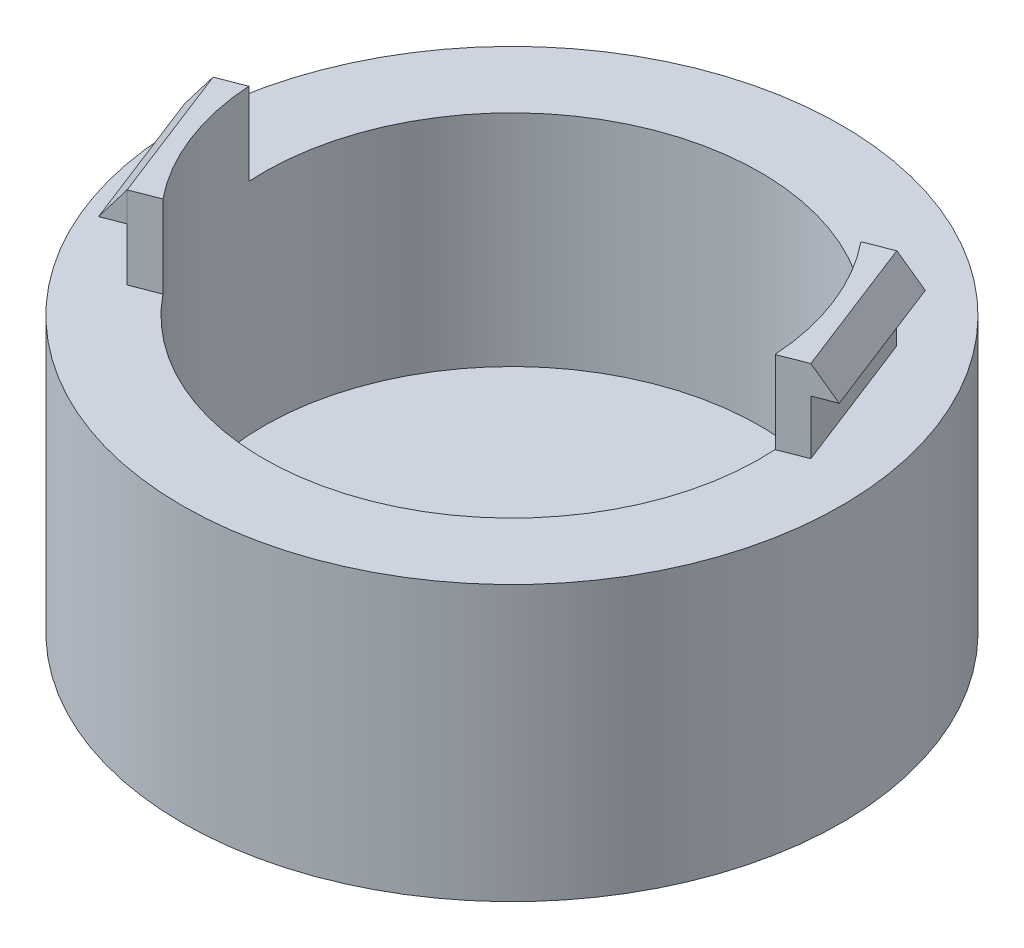
ISO-10303-21;
HEADER;
FILE_DESCRIPTION(('STEP AP214'),'2;1');
FILE_NAME('part.step','',(''),(''),'','','');
FILE_SCHEMA(('AUTOMOTIVE_DESIGN { 1 0 10303 214 1 1 1 1 }'));
ENDSEC;
DATA;
#1=APPLICATION_CONTEXT('core data for automotive mechanical design processes');
#2=APPLICATION_PROTOCOL_DEFINITION('international standard','automotive_design',2000,#1);
#3=PRODUCT_CONTEXT('',#1,'mechanical');
#4=PRODUCT('Part','Part','',(#3));
#5=PRODUCT_RELATED_PRODUCT_CATEGORY('part','',(#4));
#6=PRODUCT_DEFINITION_FORMATION('','',#4);
#7=PRODUCT_DEFINITION_CONTEXT('part definition',#1,'design');
#8=PRODUCT_DEFINITION('design','',#6,#7);
#9=PRODUCT_DEFINITION_SHAPE('','',#8);
#10=(LENGTH_UNIT() NAMED_UNIT(*) SI_UNIT(.MILLI.,.METRE.));
#11=(NAMED_UNIT(*) PLANE_ANGLE_UNIT() SI_UNIT($,.RADIAN.));
#12=(NAMED_UNIT(*) SI_UNIT($,.STERADIAN.) SOLID_ANGLE_UNIT());
#13=UNCERTAINTY_MEASURE_WITH_UNIT(LENGTH_MEASURE(1.E-05),#10,'distance_accuracy_value','');
#14=(GEOMETRIC_REPRESENTATION_CONTEXT(3) GLOBAL_UNCERTAINTY_ASSIGNED_CONTEXT((#13)) GLOBAL_UNIT_ASSIGNED_CONTEXT((#10,
#11,#12)) REPRESENTATION_CONTEXT('',''));
#15=CARTESIAN_POINT('',(0.,0.,0.));
#16=DIRECTION('',(0.,0.,1.));
#17=DIRECTION('',(1.,0.,0.));
#18=AXIS2_PLACEMENT_3D('',#15,#16,#17);
#19=CARTESIAN_POINT('',(0.,12.7,0.));
#20=DIRECTION('',(0.,-1.,0.));
#21=DIRECTION('',(0.,0.,-1.));
#22=AXIS2_PLACEMENT_3D('',#19,#20,#21);
#23=CYLINDRICAL_SURFACE('',#22,15.24);
#24=CARTESIAN_POINT('',(0.,12.7,0.));
#25=DIRECTION('',(0.,1.,0.));
#26=DIRECTION('',(0.,0.,1.));
#27=AXIS2_PLACEMENT_3D('',#24,#25,#26);
#28=CIRCLE('',#27,15.24);
#29=CARTESIAN_POINT('',(0.,12.7,15.24));
#30=VERTEX_POINT('',#29);
#31=EDGE_CURVE('E11',#30,#30,#28,.T.);
#32=ORIENTED_EDGE('',*,*,#31,.F.);
#33=EDGE_LOOP('',(#32));
#34=FACE_BOUND('',#33,.T.);
#35=CARTESIAN_POINT('',(0.,0.,0.));
#36=DIRECTION('',(0.,1.,0.));
#37=DIRECTION('',(0.,0.,1.));
#38=AXIS2_PLACEMENT_3D('',#35,#36,#37);
#39=CIRCLE('',#38,15.24);
#40=CARTESIAN_POINT('',(0.,0.,15.24));
#41=VERTEX_POINT('',#40);
#42=EDGE_CURVE('E38',#41,#41,#39,.T.);
#43=ORIENTED_EDGE('',*,*,#42,.T.);
#44=EDGE_LOOP('',(#43));
#45=FACE_BOUND('',#44,.T.);
#46=ADVANCED_FACE('F35',(#34,#45),#23,.T.);
#47=CARTESIAN_POINT('',(0.,12.7,0.));
#48=DIRECTION('',(0.,1.,0.));
#49=DIRECTION('',(0.,0.,1.));
#50=AXIS2_PLACEMENT_3D('',#47,#48,#49);
#51=PLANE('',#50);
#52=CARTESIAN_POINT('',(0.,12.7,0.));
#53=DIRECTION('',(0.,1.,0.));
#54=DIRECTION('',(0.,0.,1.));
#55=AXIS2_PLACEMENT_3D('',#52,#53,#54);
#56=CIRCLE('',#55,11.4770202930891);
#57=CARTESIAN_POINT('',(8.94183946970895,12.7,-7.19482464733737));
#58=VERTEX_POINT('',#57);
#59=CARTESIAN_POINT('',(-11.4549019665179,12.7,0.712190806907476));
#60=VERTEX_POINT('',#59);
#61=EDGE_CURVE('E160',#58,#60,#56,.T.);
#62=ORIENTED_EDGE('',*,*,#61,.F.);
#63=DIRECTION('',(-0.362453106541689,0.,-0.932002009417512));
#64=VECTOR('',#63,1.);
#65=CARTESIAN_POINT('',(10.1975921592768,12.7,-3.96581651115225));
#66=LINE('',#65,#64);
#67=CARTESIAN_POINT('',(8.93331892025488,12.7,-7.21673415526875));
#68=VERTEX_POINT('',#67);
#69=EDGE_CURVE('E194',#58,#68,#66,.T.);
#70=ORIENTED_EDGE('',*,*,#69,.T.);
#71=DIRECTION('',(-0.932002009417512,0.,0.362453106541688));
#72=VECTOR('',#71,1.);
#73=CARTESIAN_POINT('',(-1.26427323902192,12.7,-3.25091764411651));
#74=LINE('',#73,#72);
#75=CARTESIAN_POINT('',(10.1169614722151,12.7,-7.6770496005767));
#76=VERTEX_POINT('',#75);
#77=EDGE_CURVE('E197',#76,#68,#74,.T.);
#78=ORIENTED_EDGE('',*,*,#77,.F.);
#79=DIRECTION('',(-0.362453106541689,0.,-0.932002009417512));
#80=VECTOR('',#79,1.);
#81=CARTESIAN_POINT('',(11.381234711237,12.7,-4.42613195646019));
#82=LINE('',#81,#80);
#83=CARTESIAN_POINT('',(12.645507950259,12.7,-1.17521431234369));
#84=VERTEX_POINT('',#83);
#85=EDGE_CURVE('E200',#84,#76,#82,.T.);
#86=ORIENTED_EDGE('',*,*,#85,.F.);
#87=DIRECTION('',(-0.932002009417512,0.,0.362453106541688));
#88=VECTOR('',#87,1.);
#89=CARTESIAN_POINT('',(1.26427323902192,12.7,3.2509176441165));
#90=LINE('',#89,#88);
#91=CARTESIAN_POINT('',(11.4618653982987,12.7,-0.714898867035743));
#92=VERTEX_POINT('',#91);
#93=EDGE_CURVE('E168',#84,#92,#90,.T.);
#94=ORIENTED_EDGE('',*,*,#93,.T.);
#95=DIRECTION('',(-0.362453106541689,0.,-0.932002009417512));
#96=VECTOR('',#95,1.);
#97=CARTESIAN_POINT('',(10.1975921592768,12.7,-3.96581651115225));
#98=LINE('',#97,#96);
#99=CARTESIAN_POINT('',(11.4533448488447,12.7,-0.736808374967137));
#100=VERTEX_POINT('',#99);
#101=EDGE_CURVE('E163',#92,#100,#98,.T.);
#102=ORIENTED_EDGE('',*,*,#101,.T.);
#103=CARTESIAN_POINT('',(-8.92635548847401,12.7,7.21402609514049));
#104=VERTEX_POINT('',#103);
#105=EDGE_CURVE('E145',#104,#100,#56,.T.);
#106=ORIENTED_EDGE('',*,*,#105,.F.);
#107=DIRECTION('',(0.932002009417511,0.,-0.362453106541689));
#108=VECTOR('',#107,1.);
#109=CARTESIAN_POINT('',(1.26427323902192,12.7,3.25091764411649));
#110=LINE('',#109,#108);
#111=CARTESIAN_POINT('',(-10.1169614722151,12.7,7.6770496005767));
#112=VERTEX_POINT('',#111);
#113=EDGE_CURVE('E224',#112,#104,#110,.T.);
#114=ORIENTED_EDGE('',*,*,#113,.F.);
#115=DIRECTION('',(-0.362453106541689,0.,-0.932002009417511));
#116=VECTOR('',#115,1.);
#117=CARTESIAN_POINT('',(-11.381234711237,12.7,4.4261319564602));
#118=LINE('',#117,#116);
#119=CARTESIAN_POINT('',(-12.645507950259,12.7,1.17521431234369));
#120=VERTEX_POINT('',#119);
#121=EDGE_CURVE('E227',#112,#120,#118,.T.);
#122=ORIENTED_EDGE('',*,*,#121,.T.);
#123=DIRECTION('',(0.932002009417511,0.,-0.362453106541689));
#124=VECTOR('',#123,1.);
#125=CARTESIAN_POINT('',(-1.26427323902193,12.7,-3.25091764411651));
#126=LINE('',#125,#124);
#127=EDGE_CURVE('E230',#120,#60,#126,.T.);
#128=ORIENTED_EDGE('',*,*,#127,.T.);
#129=EDGE_LOOP('',(#62,#70,#78,#86,#94,#102,#106,#114,#122,#128));
#130=FACE_BOUND('',#129,.T.);
#131=ORIENTED_EDGE('',*,*,#31,.T.);
#132=EDGE_LOOP('',(#131));
#133=FACE_BOUND('',#132,.T.);
#134=ADVANCED_FACE('F164',(#130,#133),#51,.T.);
#135=CARTESIAN_POINT('',(0.,0.,0.));
#136=DIRECTION('',(0.,1.,0.));
#137=DIRECTION('',(0.,0.,1.));
#138=AXIS2_PLACEMENT_3D('',#135,#136,#137);
#139=PLANE('',#138);
#140=ORIENTED_EDGE('',*,*,#42,.F.);
#141=EDGE_LOOP('',(#140));
#142=FACE_BOUND('',#141,.T.);
#143=ADVANCED_FACE('F327',(#142),#139,.F.);
#144=CARTESIAN_POINT('',(0.,16.51,0.));
#145=DIRECTION('',(0.,-1.,0.));
#146=DIRECTION('',(0.,0.,-1.));
#147=AXIS2_PLACEMENT_3D('',#144,#145,#146);
#148=CYLINDRICAL_SURFACE('',#147,11.4770202930891);
#149=DIRECTION('',(0.,-1.,0.));
#150=VECTOR('',#149,1.);
#151=CARTESIAN_POINT('',(8.94183946970895,16.51,-7.19482464733736));
#152=LINE('',#151,#150);
#153=CARTESIAN_POINT('',(8.94183946970895,16.51,-7.19482464733736));
#154=VERTEX_POINT('',#153);
#155=EDGE_CURVE('E191',#154,#58,#152,.T.);
#156=ORIENTED_EDGE('',*,*,#155,.T.);
#157=ORIENTED_EDGE('',*,*,#61,.T.);
#158=DIRECTION('',(0.,-1.,0.));
#159=VECTOR('',#158,1.);
#160=CARTESIAN_POINT('',(-11.4549019665179,16.51,0.712190806907476));
#161=LINE('',#160,#159);
#162=CARTESIAN_POINT('',(-11.4549019665179,16.51,0.712190806907476));
#163=VERTEX_POINT('',#162);
#164=EDGE_CURVE('E171',#163,#60,#161,.T.);
#165=ORIENTED_EDGE('',*,*,#164,.F.);
#166=CARTESIAN_POINT('',(0.,16.51,0.));
#167=DIRECTION('',(0.,1.,0.));
#168=DIRECTION('',(0.,0.,1.));
#169=AXIS2_PLACEMENT_3D('',#166,#167,#168);
#170=CIRCLE('',#169,11.4770202930891);
#171=CARTESIAN_POINT('',(-8.92635548847401,16.51,7.21402609514049));
#172=VERTEX_POINT('',#171);
#173=EDGE_CURVE('E226',#163,#172,#170,.T.);
#174=ORIENTED_EDGE('',*,*,#173,.T.);
#175=DIRECTION('',(0.,-1.,0.));
#176=VECTOR('',#175,1.);
#177=CARTESIAN_POINT('',(-8.92635548847401,16.51,7.21402609514049));
#178=LINE('',#177,#176);
#179=EDGE_CURVE('E156',#172,#104,#178,.T.);
#180=ORIENTED_EDGE('',*,*,#179,.T.);
#181=ORIENTED_EDGE('',*,*,#105,.T.);
#182=DIRECTION('',(0.,-1.,0.));
#183=VECTOR('',#182,1.);
#184=CARTESIAN_POINT('',(11.4533448488447,16.51,-0.736808374967137));
#185=LINE('',#184,#183);
#186=CARTESIAN_POINT('',(11.4533448488447,16.51,-0.736808374967137));
#187=VERTEX_POINT('',#186);
#188=EDGE_CURVE('E152',#187,#100,#185,.T.);
#189=ORIENTED_EDGE('',*,*,#188,.F.);
#190=CARTESIAN_POINT('',(0.,16.51,0.));
#191=DIRECTION('',(0.,1.,0.));
#192=DIRECTION('',(0.,0.,1.));
#193=AXIS2_PLACEMENT_3D('',#190,#191,#192);
#194=CIRCLE('',#193,11.4770202930891);
#195=EDGE_CURVE('E196',#187,#154,#194,.T.);
#196=ORIENTED_EDGE('',*,*,#195,.T.);
#197=EDGE_LOOP('',(#156,#157,#165,#174,#180,#181,#189,#196));
#198=FACE_BOUND('',#197,.T.);
#199=CARTESIAN_POINT('',(0.,2.54,0.));
#200=DIRECTION('',(0.,1.,0.));
#201=DIRECTION('',(0.,0.,1.));
#202=AXIS2_PLACEMENT_3D('',#199,#200,#201);
#203=CIRCLE('',#202,11.4770202930891);
#204=CARTESIAN_POINT('',(0.,2.54,11.4770202930891));
#205=VERTEX_POINT('',#204);
#206=EDGE_CURVE('E280',#205,#205,#203,.T.);
#207=ORIENTED_EDGE('',*,*,#206,.F.);
#208=EDGE_LOOP('',(#207));
#209=FACE_BOUND('',#208,.T.);
#210=ADVANCED_FACE('F148',(#198,#209),#148,.F.);
#211=CARTESIAN_POINT('',(10.1975921592768,16.51,-3.96581651115225));
#212=DIRECTION('',(-0.932002009417511,0.,0.362453106541689));
#213=DIRECTION('',(0.362453106541689,0.,0.932002009417512));
#214=AXIS2_PLACEMENT_3D('',#211,#212,#213);
#215=PLANE('',#214);
#216=ORIENTED_EDGE('',*,*,#101,.F.);
#217=DIRECTION('',(0.,-1.,0.));
#218=VECTOR('',#217,1.);
#219=CARTESIAN_POINT('',(11.4618653982987,16.51,-0.714898867035743));
#220=LINE('',#219,#218);
#221=CARTESIAN_POINT('',(11.4618653982987,16.51,-0.714898867035743));
#222=VERTEX_POINT('',#221);
#223=EDGE_CURVE('E177',#222,#92,#220,.T.);
#224=ORIENTED_EDGE('',*,*,#223,.F.);
#225=DIRECTION('',(-0.362453106541689,0.,-0.932002009417512));
#226=VECTOR('',#225,1.);
#227=CARTESIAN_POINT('',(10.1975921592768,16.51,-3.96581651115225));
#228=LINE('',#227,#226);
#229=EDGE_CURVE('E176',#222,#187,#228,.T.);
#230=ORIENTED_EDGE('',*,*,#229,.T.);
#231=ORIENTED_EDGE('',*,*,#188,.T.);
#232=EDGE_LOOP('',(#216,#224,#230,#231));
#233=FACE_BOUND('',#232,.T.);
#234=ADVANCED_FACE('F174',(#233),#215,.T.);
#235=CARTESIAN_POINT('',(1.26427323902192,16.51,3.2509176441165));
#236=DIRECTION('',(0.362453106541688,0.,0.932002009417512));
#237=DIRECTION('',(0.932002009417512,0.,-0.362453106541688));
#238=AXIS2_PLACEMENT_3D('',#235,#236,#237);
#239=PLANE('',#238);
#240=ORIENTED_EDGE('',*,*,#93,.F.);
#241=DIRECTION('',(0.,-1.,0.));
#242=VECTOR('',#241,1.);
#243=CARTESIAN_POINT('',(12.645507950259,16.51,-1.17521431234369));
#244=LINE('',#243,#242);
#245=CARTESIAN_POINT('',(12.645507950259,15.2075731473076,-1.17521431234369));
#246=VERTEX_POINT('',#245);
#247=EDGE_CURVE('E180',#246,#84,#244,.T.);
#248=ORIENTED_EDGE('',*,*,#247,.F.);
#249=DIRECTION('',(0.932002009417512,0.,-0.362453106541688));
#250=VECTOR('',#249,1.);
#251=CARTESIAN_POINT('',(12.645507950259,15.2075731473076,-1.17521431234369));
#252=LINE('',#251,#250);
#253=CARTESIAN_POINT('',(13.5924219918272,15.2075731473076,-1.54346666859004));
#254=VERTEX_POINT('',#253);
#255=EDGE_CURVE('E273',#246,#254,#252,.T.);
#256=ORIENTED_EDGE('',*,*,#255,.T.);
#257=DIRECTION('',(-0.57324842596086,0.788470875348528,0.222934790601475));
#258=VECTOR('',#257,1.);
#259=CARTESIAN_POINT('',(13.5924219918272,15.2075731473076,-1.54346666859004));
#260=LINE('',#259,#258);
#261=CARTESIAN_POINT('',(12.645507950259,16.51,-1.17521431234369));
#262=VERTEX_POINT('',#261);
#263=EDGE_CURVE('E277',#254,#262,#260,.T.);
#264=ORIENTED_EDGE('',*,*,#263,.T.);
#265=DIRECTION('',(-0.932002009417512,0.,0.362453106541688));
#266=VECTOR('',#265,1.);
#267=CARTESIAN_POINT('',(1.26427323902192,16.51,3.2509176441165));
#268=LINE('',#267,#266);
#269=EDGE_CURVE('E211',#262,#222,#268,.T.);
#270=ORIENTED_EDGE('',*,*,#269,.T.);
#271=ORIENTED_EDGE('',*,*,#223,.T.);
#272=EDGE_LOOP('',(#240,#248,#256,#264,#270,#271));
#273=FACE_BOUND('',#272,.T.);
#274=ADVANCED_FACE('F341',(#273),#239,.T.);
#275=CARTESIAN_POINT('',(11.381234711237,16.51,-4.42613195646019));
#276=DIRECTION('',(-0.932002009417511,0.,0.362453106541689));
#277=DIRECTION('',(0.362453106541689,0.,0.932002009417512));
#278=AXIS2_PLACEMENT_3D('',#275,#276,#277);
#279=PLANE('',#278);
#280=DIRECTION('',(0.,-1.,0.));
#281=VECTOR('',#280,1.);
#282=CARTESIAN_POINT('',(10.1169614722151,16.51,-7.6770496005767));
#283=LINE('',#282,#281);
#284=CARTESIAN_POINT('',(10.1169614722151,15.2075731473076,-7.6770496005767));
#285=VERTEX_POINT('',#284);
#286=EDGE_CURVE('E187',#285,#76,#283,.T.);
#287=ORIENTED_EDGE('',*,*,#286,.F.);
#288=DIRECTION('',(0.362453106541688,0.,0.932002009417512));
#289=VECTOR('',#288,1.);
#290=CARTESIAN_POINT('',(10.1137730010653,15.2075731473076,-7.68524834812501));
#291=LINE('',#290,#289);
#292=EDGE_CURVE('E267',#285,#246,#291,.T.);
#293=ORIENTED_EDGE('',*,*,#292,.T.);
#294=ORIENTED_EDGE('',*,*,#247,.T.);
#295=ORIENTED_EDGE('',*,*,#85,.T.);
#296=EDGE_LOOP('',(#287,#293,#294,#295));
#297=FACE_BOUND('',#296,.T.);
#298=ADVANCED_FACE('F344',(#297),#279,.F.);
#299=CARTESIAN_POINT('',(-1.26427323902192,16.51,-3.25091764411651));
#300=DIRECTION('',(0.362453106541688,0.,0.932002009417512));
#301=DIRECTION('',(0.932002009417512,0.,-0.362453106541688));
#302=AXIS2_PLACEMENT_3D('',#299,#300,#301);
#303=PLANE('',#302);
#304=ORIENTED_EDGE('',*,*,#77,.T.);
#305=DIRECTION('',(0.,-1.,0.));
#306=VECTOR('',#305,1.);
#307=CARTESIAN_POINT('',(8.93331892025488,16.51,-7.21673415526875));
#308=LINE('',#307,#306);
#309=CARTESIAN_POINT('',(8.93331892025488,16.51,-7.21673415526875));
#310=VERTEX_POINT('',#309);
#311=EDGE_CURVE('E188',#310,#68,#308,.T.);
#312=ORIENTED_EDGE('',*,*,#311,.F.);
#313=DIRECTION('',(-0.932002009417512,0.,0.362453106541688));
#314=VECTOR('',#313,1.);
#315=CARTESIAN_POINT('',(-1.26427323902192,16.51,-3.25091764411651));
#316=LINE('',#315,#314);
#317=CARTESIAN_POINT('',(10.1169614722151,16.51,-7.6770496005767));
#318=VERTEX_POINT('',#317);
#319=EDGE_CURVE('E206',#318,#310,#316,.T.);
#320=ORIENTED_EDGE('',*,*,#319,.F.);
#321=EDGE_CURVE('E184',#318,#285,#283,.T.);
#322=ORIENTED_EDGE('',*,*,#321,.T.);
#323=ORIENTED_EDGE('',*,*,#286,.T.);
#324=EDGE_LOOP('',(#304,#312,#320,#322,#323));
#325=FACE_BOUND('',#324,.T.);
#326=ADVANCED_FACE('F348',(#325),#303,.F.);
#327=CARTESIAN_POINT('',(10.1975921592768,16.51,-3.96581651115225));
#328=DIRECTION('',(-0.932002009417511,0.,0.362453106541689));
#329=DIRECTION('',(0.362453106541689,0.,0.932002009417512));
#330=AXIS2_PLACEMENT_3D('',#327,#328,#329);
#331=PLANE('',#330);
#332=ORIENTED_EDGE('',*,*,#69,.F.);
#333=ORIENTED_EDGE('',*,*,#155,.F.);
#334=DIRECTION('',(-0.362453106541689,0.,-0.932002009417512));
#335=VECTOR('',#334,1.);
#336=CARTESIAN_POINT('',(10.1975921592768,16.51,-3.96581651115225));
#337=LINE('',#336,#335);
#338=EDGE_CURVE('E193',#154,#310,#337,.T.);
#339=ORIENTED_EDGE('',*,*,#338,.T.);
#340=ORIENTED_EDGE('',*,*,#311,.T.);
#341=EDGE_LOOP('',(#332,#333,#339,#340));
#342=FACE_BOUND('',#341,.T.);
#343=ADVANCED_FACE('F352',(#342),#331,.T.);
#344=CARTESIAN_POINT('',(0.,16.51,0.));
#345=DIRECTION('',(0.,1.,0.));
#346=DIRECTION('',(0.,0.,1.));
#347=AXIS2_PLACEMENT_3D('',#344,#345,#346);
#348=PLANE('',#347);
#349=ORIENTED_EDGE('',*,*,#195,.F.);
#350=ORIENTED_EDGE('',*,*,#229,.F.);
#351=ORIENTED_EDGE('',*,*,#269,.F.);
#352=DIRECTION('',(-0.362453106541689,0.,-0.932002009417512));
#353=VECTOR('',#352,1.);
#354=CARTESIAN_POINT('',(11.381234711237,16.51,-4.42613195646019));
#355=LINE('',#354,#353);
#356=EDGE_CURVE('E208',#262,#318,#355,.T.);
#357=ORIENTED_EDGE('',*,*,#356,.T.);
#358=ORIENTED_EDGE('',*,*,#319,.T.);
#359=ORIENTED_EDGE('',*,*,#338,.F.);
#360=EDGE_LOOP('',(#349,#350,#351,#357,#358,#359));
#361=FACE_BOUND('',#360,.T.);
#362=ADVANCED_FACE('F356',(#361),#348,.T.);
#363=CARTESIAN_POINT('',(-1.26427323902193,16.51,-3.25091764411651));
#364=DIRECTION('',(-0.362453106541689,0.,-0.932002009417511));
#365=DIRECTION('',(-0.932002009417511,0.,0.362453106541689));
#366=AXIS2_PLACEMENT_3D('',#363,#364,#365);
#367=PLANE('',#366);
#368=ORIENTED_EDGE('',*,*,#127,.F.);
#369=DIRECTION('',(0.,-1.,0.));
#370=VECTOR('',#369,1.);
#371=CARTESIAN_POINT('',(-12.645507950259,16.51,1.17521431234369));
#372=LINE('',#371,#370);
#373=CARTESIAN_POINT('',(-12.645507950259,15.1578654975566,1.17521431234369));
#374=VERTEX_POINT('',#373);
#375=EDGE_CURVE('E218',#374,#120,#372,.T.);
#376=ORIENTED_EDGE('',*,*,#375,.F.);
#377=DIRECTION('',(-0.932002009417511,0.,0.362453106541689));
#378=VECTOR('',#377,1.);
#379=CARTESIAN_POINT('',(-12.645507950259,15.1578654975566,1.17521431234369));
#380=LINE('',#379,#378);
#381=CARTESIAN_POINT('',(-13.5924219918272,15.1578654975566,1.54346666859005));
#382=VERTEX_POINT('',#381);
#383=EDGE_CURVE('E250',#374,#382,#380,.T.);
#384=ORIENTED_EDGE('',*,*,#383,.T.);
#385=DIRECTION('',(0.559870752323709,0.799460698536187,-0.217732248848248));
#386=VECTOR('',#385,1.);
#387=CARTESIAN_POINT('',(-13.5924219918272,15.1578654975566,1.54346666859005));
#388=LINE('',#387,#386);
#389=CARTESIAN_POINT('',(-12.645507950259,16.51,1.17521431234369));
#390=VERTEX_POINT('',#389);
#391=EDGE_CURVE('E254',#382,#390,#388,.T.);
#392=ORIENTED_EDGE('',*,*,#391,.T.);
#393=DIRECTION('',(0.932002009417511,0.,-0.362453106541689));
#394=VECTOR('',#393,1.);
#395=CARTESIAN_POINT('',(-1.26427323902193,16.51,-3.25091764411651));
#396=LINE('',#395,#394);
#397=EDGE_CURVE('E238',#390,#163,#396,.T.);
#398=ORIENTED_EDGE('',*,*,#397,.T.);
#399=ORIENTED_EDGE('',*,*,#164,.T.);
#400=EDGE_LOOP('',(#368,#376,#384,#392,#398,#399));
#401=FACE_BOUND('',#400,.T.);
#402=ADVANCED_FACE('F295',(#401),#367,.T.);
#403=CARTESIAN_POINT('',(-11.381234711237,16.51,4.4261319564602));
#404=DIRECTION('',(-0.932002009417511,0.,0.362453106541689));
#405=DIRECTION('',(0.362453106541689,0.,0.932002009417512));
#406=AXIS2_PLACEMENT_3D('',#403,#404,#405);
#407=PLANE('',#406);
#408=DIRECTION('',(-0.362453106541689,0.,-0.932002009417511));
#409=VECTOR('',#408,1.);
#410=CARTESIAN_POINT('',(-10.1122177793017,15.1578654975566,7.68924740285106));
#411=LINE('',#410,#409);
#412=CARTESIAN_POINT('',(-10.1169614722151,15.1578654975566,7.6770496005767));
#413=VERTEX_POINT('',#412);
#414=EDGE_CURVE('E49',#413,#374,#411,.T.);
#415=ORIENTED_EDGE('',*,*,#414,.T.);
#416=ORIENTED_EDGE('',*,*,#375,.T.);
#417=ORIENTED_EDGE('',*,*,#121,.F.);
#418=DIRECTION('',(0.,-1.,0.));
#419=VECTOR('',#418,1.);
#420=CARTESIAN_POINT('',(-10.1169614722151,16.51,7.6770496005767));
#421=LINE('',#420,#419);
#422=EDGE_CURVE('E54',#413,#112,#421,.T.);
#423=ORIENTED_EDGE('',*,*,#422,.F.);
#424=EDGE_LOOP('',(#415,#416,#417,#423));
#425=FACE_BOUND('',#424,.T.);
#426=ADVANCED_FACE('F296',(#425),#407,.T.);
#427=CARTESIAN_POINT('',(1.26427323902192,16.51,3.25091764411649));
#428=DIRECTION('',(-0.362453106541689,0.,-0.932002009417511));
#429=DIRECTION('',(-0.932002009417511,0.,0.362453106541689));
#430=AXIS2_PLACEMENT_3D('',#427,#428,#429);
#431=PLANE('',#430);
#432=ORIENTED_EDGE('',*,*,#113,.T.);
#433=ORIENTED_EDGE('',*,*,#179,.F.);
#434=DIRECTION('',(0.932002009417511,0.,-0.362453106541689));
#435=VECTOR('',#434,1.);
#436=CARTESIAN_POINT('',(1.26427323902192,16.51,3.25091764411649));
#437=LINE('',#436,#435);
#438=CARTESIAN_POINT('',(-10.1169614722151,16.51,7.6770496005767));
#439=VERTEX_POINT('',#438);
#440=EDGE_CURVE('E223',#439,#172,#437,.T.);
#441=ORIENTED_EDGE('',*,*,#440,.F.);
#442=EDGE_CURVE('E220',#439,#413,#421,.T.);
#443=ORIENTED_EDGE('',*,*,#442,.T.);
#444=ORIENTED_EDGE('',*,*,#422,.T.);
#445=EDGE_LOOP('',(#432,#433,#441,#443,#444));
#446=FACE_BOUND('',#445,.T.);
#447=ADVANCED_FACE('F313',(#446),#431,.F.);
#448=CARTESIAN_POINT('',(0.,16.51,0.));
#449=DIRECTION('',(0.,1.,0.));
#450=DIRECTION('',(0.,0.,1.));
#451=AXIS2_PLACEMENT_3D('',#448,#449,#450);
#452=PLANE('',#451);
#453=ORIENTED_EDGE('',*,*,#173,.F.);
#454=ORIENTED_EDGE('',*,*,#397,.F.);
#455=DIRECTION('',(-0.362453106541689,0.,-0.932002009417511));
#456=VECTOR('',#455,1.);
#457=CARTESIAN_POINT('',(-11.381234711237,16.51,4.4261319564602));
#458=LINE('',#457,#456);
#459=EDGE_CURVE('E235',#439,#390,#458,.T.);
#460=ORIENTED_EDGE('',*,*,#459,.F.);
#461=ORIENTED_EDGE('',*,*,#440,.T.);
#462=EDGE_LOOP('',(#453,#454,#460,#461));
#463=FACE_BOUND('',#462,.T.);
#464=ADVANCED_FACE('F308',(#463),#452,.T.);
#465=CARTESIAN_POINT('',(-10.1122177793017,16.51,7.68924740285106));
#466=DIRECTION('',(0.932002009417511,0.,-0.362453106541689));
#467=DIRECTION('',(-0.362453106541689,0.,-0.932002009417511));
#468=AXIS2_PLACEMENT_3D('',#465,#466,#467);
#469=PLANE('',#468);
#470=ORIENTED_EDGE('',*,*,#442,.F.);
#471=DIRECTION('',(-0.362453106541689,0.,-0.932002009417511));
#472=VECTOR('',#471,1.);
#473=CARTESIAN_POINT('',(-10.1122177793017,16.51,7.68924740285106));
#474=LINE('',#473,#472);
#475=CARTESIAN_POINT('',(-10.1122177793017,16.51,7.68924740285106));
#476=VERTEX_POINT('',#475);
#477=EDGE_CURVE('E242',#476,#439,#474,.T.);
#478=ORIENTED_EDGE('',*,*,#477,.F.);
#479=DIRECTION('',(0.,-1.,0.));
#480=VECTOR('',#479,1.);
#481=CARTESIAN_POINT('',(-10.1122177793017,16.51,7.68924740285106));
#482=LINE('',#481,#480);
#483=CARTESIAN_POINT('',(-10.1122177793017,15.1578654975566,7.68924740285106));
#484=VERTEX_POINT('',#483);
#485=EDGE_CURVE('E260',#476,#484,#482,.T.);
#486=ORIENTED_EDGE('',*,*,#485,.T.);
#487=EDGE_CURVE('E246',#484,#413,#411,.T.);
#488=ORIENTED_EDGE('',*,*,#487,.T.);
#489=EDGE_LOOP('',(#470,#478,#486,#488));
#490=FACE_BOUND('',#489,.T.);
#491=ADVANCED_FACE('F310',(#490),#469,.T.);
#492=CARTESIAN_POINT('',(-11.0591318208699,15.1578654975566,8.05749975909741));
#493=DIRECTION('',(-0.745098977486054,0.600718396169146,0.28976701374243));
#494=DIRECTION('',(-0.627646165042067,-0.778498742136419,0.));
#495=AXIS2_PLACEMENT_3D('',#492,#493,#494);
#496=PLANE('',#495);
#497=ORIENTED_EDGE('',*,*,#391,.F.);
#498=DIRECTION('',(-0.362453106541689,0.,-0.932002009417511));
#499=VECTOR('',#498,1.);
#500=CARTESIAN_POINT('',(-11.0591318208699,15.1578654975566,8.05749975909741));
#501=LINE('',#500,#499);
#502=CARTESIAN_POINT('',(-11.0591318208699,15.1578654975566,8.05749975909741));
#503=VERTEX_POINT('',#502);
#504=EDGE_CURVE('E233',#503,#382,#501,.T.);
#505=ORIENTED_EDGE('',*,*,#504,.F.);
#506=DIRECTION('',(0.559870752323709,0.799460698536187,-0.217732248848248));
#507=VECTOR('',#506,1.);
#508=CARTESIAN_POINT('',(-11.0591318208699,15.1578654975566,8.05749975909741));
#509=LINE('',#508,#507);
#510=EDGE_CURVE('E253',#503,#476,#509,.T.);
#511=ORIENTED_EDGE('',*,*,#510,.T.);
#512=ORIENTED_EDGE('',*,*,#477,.T.);
#513=ORIENTED_EDGE('',*,*,#459,.T.);
#514=EDGE_LOOP('',(#497,#505,#511,#512,#513));
#515=FACE_BOUND('',#514,.T.);
#516=ADVANCED_FACE('F304',(#515),#496,.T.);
#517=CARTESIAN_POINT('',(-10.1122177793017,15.1578654975566,7.68924740285106));
#518=DIRECTION('',(0.,-1.,0.));
#519=DIRECTION('',(0.,0.,-1.));
#520=AXIS2_PLACEMENT_3D('',#517,#518,#519);
#521=PLANE('',#520);
#522=ORIENTED_EDGE('',*,*,#383,.F.);
#523=ORIENTED_EDGE('',*,*,#414,.F.);
#524=ORIENTED_EDGE('',*,*,#487,.F.);
#525=DIRECTION('',(-0.932002009417511,0.,0.362453106541689));
#526=VECTOR('',#525,1.);
#527=CARTESIAN_POINT('',(-10.1122177793017,15.1578654975566,7.68924740285106));
#528=LINE('',#527,#526);
#529=EDGE_CURVE('E245',#484,#503,#528,.T.);
#530=ORIENTED_EDGE('',*,*,#529,.T.);
#531=ORIENTED_EDGE('',*,*,#504,.T.);
#532=EDGE_LOOP('',(#522,#523,#524,#530,#531));
#533=FACE_BOUND('',#532,.T.);
#534=ADVANCED_FACE('F299',(#533),#521,.T.);
#535=CARTESIAN_POINT('',(1.26901693193529,0.,3.26311544639085));
#536=DIRECTION('',(0.362453106541689,0.,0.932002009417511));
#537=DIRECTION('',(0.932002009417511,0.,-0.362453106541689));
#538=AXIS2_PLACEMENT_3D('',#535,#536,#537);
#539=PLANE('',#538);
#540=ORIENTED_EDGE('',*,*,#510,.F.);
#541=ORIENTED_EDGE('',*,*,#529,.F.);
#542=ORIENTED_EDGE('',*,*,#485,.F.);
#543=EDGE_LOOP('',(#540,#541,#542));
#544=FACE_BOUND('',#543,.T.);
#545=ADVANCED_FACE('F415',(#544),#539,.T.);
#546=CARTESIAN_POINT('',(10.1137730010653,16.51,-7.68524834812501));
#547=DIRECTION('',(-0.932002009417512,0.,0.362453106541688));
#548=DIRECTION('',(0.362453106541688,0.,0.932002009417512));
#549=AXIS2_PLACEMENT_3D('',#546,#547,#548);
#550=PLANE('',#549);
#551=ORIENTED_EDGE('',*,*,#321,.F.);
#552=DIRECTION('',(0.362453106541688,0.,0.932002009417512));
#553=VECTOR('',#552,1.);
#554=CARTESIAN_POINT('',(10.1137730010653,16.51,-7.68524834812501));
#555=LINE('',#554,#553);
#556=CARTESIAN_POINT('',(10.1137730010653,16.51,-7.68524834812501));
#557=VERTEX_POINT('',#556);
#558=EDGE_CURVE('E265',#557,#318,#555,.T.);
#559=ORIENTED_EDGE('',*,*,#558,.F.);
#560=DIRECTION('',(0.,-1.,0.));
#561=VECTOR('',#560,1.);
#562=CARTESIAN_POINT('',(10.1137730010653,16.51,-7.68524834812501));
#563=LINE('',#562,#561);
#564=CARTESIAN_POINT('',(10.1137730010653,15.2075731473076,-7.68524834812501));
#565=VERTEX_POINT('',#564);
#566=EDGE_CURVE('E283',#557,#565,#563,.T.);
#567=ORIENTED_EDGE('',*,*,#566,.T.);
#568=EDGE_CURVE('E269',#565,#285,#291,.T.);
#569=ORIENTED_EDGE('',*,*,#568,.T.);
#570=EDGE_LOOP('',(#551,#559,#567,#569));
#571=FACE_BOUND('',#570,.T.);
#572=ADVANCED_FACE('F424',(#571),#550,.T.);
#573=CARTESIAN_POINT('',(11.0606870426335,15.2075731473076,-8.05350070437136));
#574=DIRECTION('',(0.734856440192012,0.615072092300672,-0.285783718187718));
#575=DIRECTION('',(-0.641840604112723,0.766838078679075,0.));
#576=AXIS2_PLACEMENT_3D('',#573,#574,#575);
#577=PLANE('',#576);
#578=ORIENTED_EDGE('',*,*,#263,.F.);
#579=DIRECTION('',(0.362453106541688,0.,0.932002009417512));
#580=VECTOR('',#579,1.);
#581=CARTESIAN_POINT('',(11.0606870426335,15.2075731473076,-8.05350070437136));
#582=LINE('',#581,#580);
#583=CARTESIAN_POINT('',(11.0606870426335,15.2075731473076,-8.05350070437136));
#584=VERTEX_POINT('',#583);
#585=EDGE_CURVE('E257',#584,#254,#582,.T.);
#586=ORIENTED_EDGE('',*,*,#585,.F.);
#587=DIRECTION('',(-0.57324842596086,0.788470875348528,0.222934790601475));
#588=VECTOR('',#587,1.);
#589=CARTESIAN_POINT('',(11.0606870426335,15.2075731473076,-8.05350070437136));
#590=LINE('',#589,#588);
#591=EDGE_CURVE('E276',#584,#557,#590,.T.);
#592=ORIENTED_EDGE('',*,*,#591,.T.);
#593=ORIENTED_EDGE('',*,*,#558,.T.);
#594=ORIENTED_EDGE('',*,*,#356,.F.);
#595=EDGE_LOOP('',(#578,#586,#592,#593,#594));
#596=FACE_BOUND('',#595,.T.);
#597=ADVANCED_FACE('F459',(#596),#577,.T.);
#598=CARTESIAN_POINT('',(10.1137730010653,15.2075731473076,-7.68524834812501));
#599=DIRECTION('',(0.,-1.,0.));
#600=DIRECTION('',(0.,0.,-1.));
#601=AXIS2_PLACEMENT_3D('',#598,#599,#600);
#602=PLANE('',#601);
#603=ORIENTED_EDGE('',*,*,#255,.F.);
#604=ORIENTED_EDGE('',*,*,#292,.F.);
#605=ORIENTED_EDGE('',*,*,#568,.F.);
#606=DIRECTION('',(0.932002009417512,0.,-0.362453106541688));
#607=VECTOR('',#606,1.);
#608=CARTESIAN_POINT('',(10.1137730010653,15.2075731473076,-7.68524834812501));
#609=LINE('',#608,#607);
#610=EDGE_CURVE('E268',#565,#584,#609,.T.);
#611=ORIENTED_EDGE('',*,*,#610,.T.);
#612=ORIENTED_EDGE('',*,*,#585,.T.);
#613=EDGE_LOOP('',(#603,#604,#605,#611,#612));
#614=FACE_BOUND('',#613,.T.);
#615=ADVANCED_FACE('F471',(#614),#602,.T.);
#616=CARTESIAN_POINT('',(-1.26746171017178,0.,-3.25911639166482));
#617=DIRECTION('',(-0.362453106541688,0.,-0.932002009417512));
#618=DIRECTION('',(-0.932002009417512,0.,0.362453106541688));
#619=AXIS2_PLACEMENT_3D('',#616,#617,#618);
#620=PLANE('',#619);
#621=ORIENTED_EDGE('',*,*,#591,.F.);
#622=ORIENTED_EDGE('',*,*,#610,.F.);
#623=ORIENTED_EDGE('',*,*,#566,.F.);
#624=EDGE_LOOP('',(#621,#622,#623));
#625=FACE_BOUND('',#624,.T.);
#626=ADVANCED_FACE('F481',(#625),#620,.T.);
#627=CARTESIAN_POINT('',(0.,2.54,0.));
#628=DIRECTION('',(0.,1.,0.));
#629=DIRECTION('',(0.,0.,1.));
#630=AXIS2_PLACEMENT_3D('',#627,#628,#629);
#631=PLANE('',#630);
#632=ORIENTED_EDGE('',*,*,#206,.T.);
#633=EDGE_LOOP('',(#632));
#634=FACE_BOUND('',#633,.T.);
#635=ADVANCED_FACE('F491',(#634),#631,.T.);
#636=CLOSED_SHELL('',(#46,#134,#143,#210,#234,#274,#298,#326,#343,#362,#402,#426,#447,#464,#491,
#516,#534,#545,#572,#597,#615,#626,#635));
#637=MANIFOLD_SOLID_BREP('B2',#636);
#638=ADVANCED_BREP_SHAPE_REPRESENTATION('',(#18,#637),#14);
#639=SHAPE_DEFINITION_REPRESENTATION(#9,#638);
ENDSEC;
END-ISO-10303-21;
